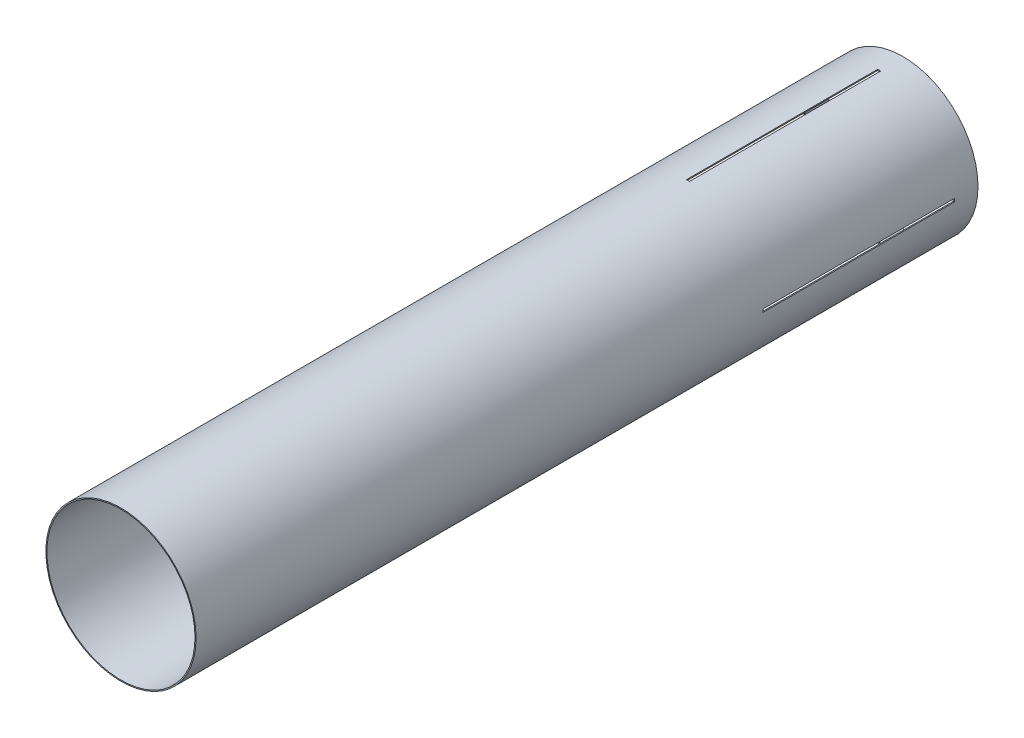
ISO-10303-21;
HEADER;
FILE_DESCRIPTION(('STEP AP214'),'2;1');
FILE_NAME('part.step','',(''),(''),'','','');
FILE_SCHEMA(('AUTOMOTIVE_DESIGN { 1 0 10303 214 1 1 1 1 }'));
ENDSEC;
DATA;
#1=APPLICATION_CONTEXT('core data for automotive mechanical design processes');
#2=APPLICATION_PROTOCOL_DEFINITION('international standard','automotive_design',2000,#1);
#3=PRODUCT_CONTEXT('',#1,'mechanical');
#4=PRODUCT('Part','Part','',(#3));
#5=PRODUCT_RELATED_PRODUCT_CATEGORY('part','',(#4));
#6=PRODUCT_DEFINITION_FORMATION('','',#4);
#7=PRODUCT_DEFINITION_CONTEXT('part definition',#1,'design');
#8=PRODUCT_DEFINITION('design','',#6,#7);
#9=PRODUCT_DEFINITION_SHAPE('','',#8);
#10=(LENGTH_UNIT() NAMED_UNIT(*) SI_UNIT(.MILLI.,.METRE.));
#11=(NAMED_UNIT(*) PLANE_ANGLE_UNIT() SI_UNIT($,.RADIAN.));
#12=(NAMED_UNIT(*) SI_UNIT($,.STERADIAN.) SOLID_ANGLE_UNIT());
#13=UNCERTAINTY_MEASURE_WITH_UNIT(LENGTH_MEASURE(1.E-05),#10,'distance_accuracy_value','');
#14=(GEOMETRIC_REPRESENTATION_CONTEXT(3) GLOBAL_UNCERTAINTY_ASSIGNED_CONTEXT((#13)) GLOBAL_UNIT_ASSIGNED_CONTEXT((#10,
#11,#12)) REPRESENTATION_CONTEXT('',''));
#15=CARTESIAN_POINT('',(0.,0.,0.));
#16=DIRECTION('',(0.,0.,1.));
#17=DIRECTION('',(1.,0.,0.));
#18=AXIS2_PLACEMENT_3D('',#15,#16,#17);
#19=CARTESIAN_POINT('',(0.,0.,838.2));
#20=DIRECTION('',(0.,0.,-1.));
#21=DIRECTION('',(-1.,0.,0.));
#22=AXIS2_PLACEMENT_3D('',#19,#20,#21);
#23=CYLINDRICAL_SURFACE('',#22,80.518);
#24=CARTESIAN_POINT('',(0.,0.,25.4));
#25=DIRECTION('',(0.,0.,-1.));
#26=DIRECTION('',(-1.,0.,0.));
#27=AXIS2_PLACEMENT_3D('',#24,#25,#26);
#28=CIRCLE('',#27,80.518);
#29=CARTESIAN_POINT('',(-80.5020973885774,-1.60020000000028,25.4));
#30=VERTEX_POINT('',#29);
#31=CARTESIAN_POINT('',(-80.5020973885774,1.60019999999972,25.4));
#32=VERTEX_POINT('',#31);
#33=EDGE_CURVE('E168',#30,#32,#28,.T.);
#34=ORIENTED_EDGE('',*,*,#33,.T.);
#35=DIRECTION('',(0.,0.,-1.));
#36=VECTOR('',#35,1.);
#37=CARTESIAN_POINT('',(-80.5020973885774,1.60019999999982,838.2));
#38=LINE('',#37,#36);
#39=CARTESIAN_POINT('',(-80.5020973885774,1.60019999999975,230.378));
#40=VERTEX_POINT('',#39);
#41=EDGE_CURVE('E251',#32,#40,#38,.F.);
#42=ORIENTED_EDGE('',*,*,#41,.T.);
#43=CARTESIAN_POINT('',(0.,0.,230.378));
#44=DIRECTION('',(0.,0.,1.));
#45=DIRECTION('',(1.,0.,0.));
#46=AXIS2_PLACEMENT_3D('',#43,#44,#45);
#47=CIRCLE('',#46,80.518);
#48=CARTESIAN_POINT('',(-80.5020973885774,-1.60020000000025,230.378));
#49=VERTEX_POINT('',#48);
#50=EDGE_CURVE('E51',#40,#49,#47,.T.);
#51=ORIENTED_EDGE('',*,*,#50,.T.);
#52=DIRECTION('',(0.,0.,-1.));
#53=VECTOR('',#52,1.);
#54=CARTESIAN_POINT('',(-80.5020973885774,-1.60020000000018,838.2));
#55=LINE('',#54,#53);
#56=EDGE_CURVE('E254',#49,#30,#55,.T.);
#57=ORIENTED_EDGE('',*,*,#56,.T.);
#58=EDGE_LOOP('',(#34,#42,#51,#57));
#59=FACE_BOUND('',#58,.T.);
#60=DIRECTION('',(0.,0.,-1.));
#61=VECTOR('',#60,1.);
#62=CARTESIAN_POINT('',(80.5020973885774,-1.60019999999926,838.2));
#63=LINE('',#62,#61);
#64=CARTESIAN_POINT('',(80.5020973885774,-1.60019999999916,25.4));
#65=VERTEX_POINT('',#64);
#66=CARTESIAN_POINT('',(80.5020973885773,-1.60019999999919,230.378));
#67=VERTEX_POINT('',#66);
#68=EDGE_CURVE('E235',#65,#67,#63,.F.);
#69=ORIENTED_EDGE('',*,*,#68,.T.);
#70=CARTESIAN_POINT('',(0.,0.,230.378));
#71=DIRECTION('',(0.,0.,1.));
#72=DIRECTION('',(1.,0.,0.));
#73=AXIS2_PLACEMENT_3D('',#70,#71,#72);
#74=CIRCLE('',#73,80.518);
#75=CARTESIAN_POINT('',(80.5020973885773,1.60020000000081,230.378));
#76=VERTEX_POINT('',#75);
#77=EDGE_CURVE('E238',#67,#76,#74,.T.);
#78=ORIENTED_EDGE('',*,*,#77,.T.);
#79=DIRECTION('',(0.,0.,-1.));
#80=VECTOR('',#79,1.);
#81=CARTESIAN_POINT('',(80.5020973885774,1.60020000000074,838.2));
#82=LINE('',#81,#80);
#83=CARTESIAN_POINT('',(80.5020973885774,1.60020000000074,25.4000000000001));
#84=VERTEX_POINT('',#83);
#85=EDGE_CURVE('E186',#76,#84,#82,.T.);
#86=ORIENTED_EDGE('',*,*,#85,.T.);
#87=CARTESIAN_POINT('',(0.,0.,25.4));
#88=DIRECTION('',(0.,0.,-1.));
#89=DIRECTION('',(-1.,0.,0.));
#90=AXIS2_PLACEMENT_3D('',#87,#88,#89);
#91=CIRCLE('',#90,80.518);
#92=EDGE_CURVE('E233',#84,#65,#91,.T.);
#93=ORIENTED_EDGE('',*,*,#92,.T.);
#94=EDGE_LOOP('',(#69,#78,#86,#93));
#95=FACE_BOUND('',#94,.T.);
#96=CARTESIAN_POINT('',(0.,0.,0.));
#97=DIRECTION('',(0.,0.,1.));
#98=DIRECTION('',(1.,0.,0.));
#99=AXIS2_PLACEMENT_3D('',#96,#97,#98);
#100=CIRCLE('',#99,80.518);
#101=CARTESIAN_POINT('',(80.518,0.,0.));
#102=VERTEX_POINT('',#101);
#103=EDGE_CURVE('E40',#102,#102,#100,.T.);
#104=ORIENTED_EDGE('',*,*,#103,.T.);
#105=EDGE_LOOP('',(#104));
#106=FACE_BOUND('',#105,.T.);
#107=CARTESIAN_POINT('',(0.,0.,838.2));
#108=DIRECTION('',(0.,0.,1.));
#109=DIRECTION('',(1.,0.,0.));
#110=AXIS2_PLACEMENT_3D('',#107,#108,#109);
#111=CIRCLE('',#110,80.518);
#112=CARTESIAN_POINT('',(80.518,0.,838.2));
#113=VERTEX_POINT('',#112);
#114=EDGE_CURVE('E11',#113,#113,#111,.T.);
#115=ORIENTED_EDGE('',*,*,#114,.F.);
#116=EDGE_LOOP('',(#115));
#117=FACE_BOUND('',#116,.T.);
#118=CARTESIAN_POINT('',(0.,0.,25.4));
#119=DIRECTION('',(0.,0.,-1.));
#120=DIRECTION('',(-1.,0.,0.));
#121=AXIS2_PLACEMENT_3D('',#118,#119,#120);
#122=CIRCLE('',#121,80.518);
#123=CARTESIAN_POINT('',(-1.6001999999999,80.5020973885774,25.4000000000001));
#124=VERTEX_POINT('',#123);
#125=CARTESIAN_POINT('',(1.6002,80.5020973885774,25.4));
#126=VERTEX_POINT('',#125);
#127=EDGE_CURVE('E282',#124,#126,#122,.T.);
#128=ORIENTED_EDGE('',*,*,#127,.T.);
#129=DIRECTION('',(0.,0.,-1.));
#130=VECTOR('',#129,1.);
#131=CARTESIAN_POINT('',(1.6002000000001,80.5020973885774,838.2));
#132=LINE('',#131,#130);
#133=CARTESIAN_POINT('',(1.60020000000003,80.5020973885774,230.378));
#134=VERTEX_POINT('',#133);
#135=EDGE_CURVE('E284',#126,#134,#132,.F.);
#136=ORIENTED_EDGE('',*,*,#135,.T.);
#137=CARTESIAN_POINT('',(0.,0.,230.378));
#138=DIRECTION('',(0.,0.,1.));
#139=DIRECTION('',(1.,0.,0.));
#140=AXIS2_PLACEMENT_3D('',#137,#138,#139);
#141=CIRCLE('',#140,80.518);
#142=CARTESIAN_POINT('',(-1.60019999999997,80.5020973885774,230.378));
#143=VERTEX_POINT('',#142);
#144=EDGE_CURVE('E287',#134,#143,#141,.T.);
#145=ORIENTED_EDGE('',*,*,#144,.T.);
#146=DIRECTION('',(0.,0.,-1.));
#147=VECTOR('',#146,1.);
#148=CARTESIAN_POINT('',(-1.6001999999999,80.5020973885774,838.2));
#149=LINE('',#148,#147);
#150=EDGE_CURVE('E274',#143,#124,#149,.T.);
#151=ORIENTED_EDGE('',*,*,#150,.T.);
#152=EDGE_LOOP('',(#128,#136,#145,#151));
#153=FACE_BOUND('',#152,.T.);
#154=CARTESIAN_POINT('',(0.,0.,25.4));
#155=DIRECTION('',(0.,0.,-1.));
#156=DIRECTION('',(-1.,0.,0.));
#157=AXIS2_PLACEMENT_3D('',#154,#155,#156);
#158=CIRCLE('',#157,80.518);
#159=CARTESIAN_POINT('',(1.6001999999999,-80.5020973885774,25.4000000000001));
#160=VERTEX_POINT('',#159);
#161=CARTESIAN_POINT('',(-1.6002,-80.5020973885774,25.4));
#162=VERTEX_POINT('',#161);
#163=EDGE_CURVE('E243',#160,#162,#158,.T.);
#164=ORIENTED_EDGE('',*,*,#163,.T.);
#165=DIRECTION('',(0.,0.,-1.));
#166=VECTOR('',#165,1.);
#167=CARTESIAN_POINT('',(-1.6002000000001,-80.5020973885774,838.2));
#168=LINE('',#167,#166);
#169=CARTESIAN_POINT('',(-1.60020000000003,-80.5020973885774,230.378));
#170=VERTEX_POINT('',#169);
#171=EDGE_CURVE('E245',#162,#170,#168,.F.);
#172=ORIENTED_EDGE('',*,*,#171,.T.);
#173=CARTESIAN_POINT('',(0.,0.,230.378));
#174=DIRECTION('',(0.,0.,1.));
#175=DIRECTION('',(1.,0.,0.));
#176=AXIS2_PLACEMENT_3D('',#173,#174,#175);
#177=CIRCLE('',#176,80.518);
#178=CARTESIAN_POINT('',(1.60019999999997,-80.5020973885774,230.378));
#179=VERTEX_POINT('',#178);
#180=EDGE_CURVE('E248',#170,#179,#177,.T.);
#181=ORIENTED_EDGE('',*,*,#180,.T.);
#182=DIRECTION('',(0.,0.,-1.));
#183=VECTOR('',#182,1.);
#184=CARTESIAN_POINT('',(1.6001999999999,-80.5020973885774,838.2));
#185=LINE('',#184,#183);
#186=EDGE_CURVE('E240',#179,#160,#185,.T.);
#187=ORIENTED_EDGE('',*,*,#186,.T.);
#188=EDGE_LOOP('',(#164,#172,#181,#187));
#189=FACE_BOUND('',#188,.T.);
#190=ADVANCED_FACE('F37',(#59,#95,#106,#117,#153,#189),#23,.T.);
#191=CARTESIAN_POINT('',(0.,0.,838.2));
#192=DIRECTION('',(0.,0.,1.));
#193=DIRECTION('',(1.,0.,0.));
#194=AXIS2_PLACEMENT_3D('',#191,#192,#193);
#195=PLANE('',#194);
#196=ORIENTED_EDGE('',*,*,#114,.T.);
#197=EDGE_LOOP('',(#196));
#198=FACE_BOUND('',#197,.T.);
#199=CARTESIAN_POINT('',(0.,0.,838.2));
#200=DIRECTION('',(0.,0.,1.));
#201=DIRECTION('',(1.,0.,0.));
#202=AXIS2_PLACEMENT_3D('',#199,#200,#201);
#203=CIRCLE('',#202,79.375);
#204=CARTESIAN_POINT('',(79.375,0.,838.2));
#205=VERTEX_POINT('',#204);
#206=EDGE_CURVE('E290',#205,#205,#203,.T.);
#207=ORIENTED_EDGE('',*,*,#206,.F.);
#208=EDGE_LOOP('',(#207));
#209=FACE_BOUND('',#208,.T.);
#210=ADVANCED_FACE('F308',(#198,#209),#195,.T.);
#211=CARTESIAN_POINT('',(0.,0.,0.));
#212=DIRECTION('',(0.,0.,1.));
#213=DIRECTION('',(1.,0.,0.));
#214=AXIS2_PLACEMENT_3D('',#211,#212,#213);
#215=PLANE('',#214);
#216=ORIENTED_EDGE('',*,*,#103,.F.);
#217=EDGE_LOOP('',(#216));
#218=FACE_BOUND('',#217,.T.);
#219=CARTESIAN_POINT('',(0.,0.,0.));
#220=DIRECTION('',(0.,0.,1.));
#221=DIRECTION('',(1.,0.,0.));
#222=AXIS2_PLACEMENT_3D('',#219,#220,#221);
#223=CIRCLE('',#222,79.375);
#224=CARTESIAN_POINT('',(79.375,0.,0.));
#225=VERTEX_POINT('',#224);
#226=EDGE_CURVE('E289',#225,#225,#223,.T.);
#227=ORIENTED_EDGE('',*,*,#226,.T.);
#228=EDGE_LOOP('',(#227));
#229=FACE_BOUND('',#228,.T.);
#230=ADVANCED_FACE('F296',(#218,#229),#215,.F.);
#231=CARTESIAN_POINT('',(0.,0.,838.2));
#232=DIRECTION('',(0.,0.,-1.));
#233=DIRECTION('',(-1.,0.,0.));
#234=AXIS2_PLACEMENT_3D('',#231,#232,#233);
#235=CYLINDRICAL_SURFACE('',#234,79.375);
#236=DIRECTION('',(0.,0.,-1.));
#237=VECTOR('',#236,1.);
#238=CARTESIAN_POINT('',(-79.358868344754,-1.60020000000018,838.2));
#239=LINE('',#238,#237);
#240=CARTESIAN_POINT('',(-79.358868344754,-1.60020000000027,25.4));
#241=VERTEX_POINT('',#240);
#242=CARTESIAN_POINT('',(-79.358868344754,-1.60020000000025,230.378));
#243=VERTEX_POINT('',#242);
#244=EDGE_CURVE('E152',#241,#243,#239,.F.);
#245=ORIENTED_EDGE('',*,*,#244,.T.);
#246=CARTESIAN_POINT('',(0.,0.,230.378));
#247=DIRECTION('',(0.,0.,1.));
#248=DIRECTION('',(1.,0.,0.));
#249=AXIS2_PLACEMENT_3D('',#246,#247,#248);
#250=CIRCLE('',#249,79.375);
#251=CARTESIAN_POINT('',(-79.358868344754,1.60019999999975,230.378));
#252=VERTEX_POINT('',#251);
#253=EDGE_CURVE('E181',#243,#252,#250,.F.);
#254=ORIENTED_EDGE('',*,*,#253,.T.);
#255=DIRECTION('',(0.,0.,-1.));
#256=VECTOR('',#255,1.);
#257=CARTESIAN_POINT('',(-79.358868344754,1.60019999999983,838.2));
#258=LINE('',#257,#256);
#259=CARTESIAN_POINT('',(-79.358868344754,1.60019999999983,25.4000000000001));
#260=VERTEX_POINT('',#259);
#261=EDGE_CURVE('E169',#252,#260,#258,.T.);
#262=ORIENTED_EDGE('',*,*,#261,.T.);
#263=CARTESIAN_POINT('',(0.,0.,25.4));
#264=DIRECTION('',(0.,0.,-1.));
#265=DIRECTION('',(-1.,0.,0.));
#266=AXIS2_PLACEMENT_3D('',#263,#264,#265);
#267=CIRCLE('',#266,79.375);
#268=EDGE_CURVE('E166',#260,#241,#267,.F.);
#269=ORIENTED_EDGE('',*,*,#268,.T.);
#270=EDGE_LOOP('',(#245,#254,#262,#269));
#271=FACE_BOUND('',#270,.T.);
#272=CARTESIAN_POINT('',(0.,0.,230.378));
#273=DIRECTION('',(0.,0.,1.));
#274=DIRECTION('',(1.,0.,0.));
#275=AXIS2_PLACEMENT_3D('',#272,#273,#274);
#276=CIRCLE('',#275,79.375);
#277=CARTESIAN_POINT('',(1.6001999999999,-79.358868344754,230.378));
#278=VERTEX_POINT('',#277);
#279=CARTESIAN_POINT('',(-1.60020000000003,-79.358868344754,230.378));
#280=VERTEX_POINT('',#279);
#281=EDGE_CURVE('E187',#278,#280,#276,.F.);
#282=ORIENTED_EDGE('',*,*,#281,.T.);
#283=DIRECTION('',(0.,0.,-1.));
#284=VECTOR('',#283,1.);
#285=CARTESIAN_POINT('',(-1.6002000000001,-79.358868344754,838.2));
#286=LINE('',#285,#284);
#287=CARTESIAN_POINT('',(-1.6002000000001,-79.358868344754,25.4000000000001));
#288=VERTEX_POINT('',#287);
#289=EDGE_CURVE('E199',#280,#288,#286,.T.);
#290=ORIENTED_EDGE('',*,*,#289,.T.);
#291=CARTESIAN_POINT('',(0.,0.,25.4));
#292=DIRECTION('',(0.,0.,-1.));
#293=DIRECTION('',(-1.,0.,0.));
#294=AXIS2_PLACEMENT_3D('',#291,#292,#293);
#295=CIRCLE('',#294,79.375);
#296=CARTESIAN_POINT('',(1.6002,-79.358868344754,25.4));
#297=VERTEX_POINT('',#296);
#298=EDGE_CURVE('E195',#288,#297,#295,.F.);
#299=ORIENTED_EDGE('',*,*,#298,.T.);
#300=DIRECTION('',(0.,0.,-1.));
#301=VECTOR('',#300,1.);
#302=CARTESIAN_POINT('',(1.6001999999999,-79.358868344754,838.2));
#303=LINE('',#302,#301);
#304=EDGE_CURVE('E192',#297,#278,#303,.F.);
#305=ORIENTED_EDGE('',*,*,#304,.T.);
#306=EDGE_LOOP('',(#282,#290,#299,#305));
#307=FACE_BOUND('',#306,.T.);
#308=CARTESIAN_POINT('',(0.,0.,230.378));
#309=DIRECTION('',(0.,0.,1.));
#310=DIRECTION('',(1.,0.,0.));
#311=AXIS2_PLACEMENT_3D('',#308,#309,#310);
#312=CIRCLE('',#311,79.375);
#313=CARTESIAN_POINT('',(79.358868344754,1.60020000000073,230.378));
#314=VERTEX_POINT('',#313);
#315=CARTESIAN_POINT('',(79.358868344754,-1.6001999999992,230.378));
#316=VERTEX_POINT('',#315);
#317=EDGE_CURVE('E209',#314,#316,#312,.F.);
#318=ORIENTED_EDGE('',*,*,#317,.T.);
#319=DIRECTION('',(0.,0.,-1.));
#320=VECTOR('',#319,1.);
#321=CARTESIAN_POINT('',(79.358868344754,-1.60019999999927,838.2));
#322=LINE('',#321,#320);
#323=CARTESIAN_POINT('',(79.358868344754,-1.60019999999927,25.4000000000001));
#324=VERTEX_POINT('',#323);
#325=EDGE_CURVE('E221',#316,#324,#322,.T.);
#326=ORIENTED_EDGE('',*,*,#325,.T.);
#327=CARTESIAN_POINT('',(0.,0.,25.4));
#328=DIRECTION('',(0.,0.,-1.));
#329=DIRECTION('',(-1.,0.,0.));
#330=AXIS2_PLACEMENT_3D('',#327,#328,#329);
#331=CIRCLE('',#330,79.375);
#332=CARTESIAN_POINT('',(79.358868344754,1.60020000000083,25.4));
#333=VERTEX_POINT('',#332);
#334=EDGE_CURVE('E217',#324,#333,#331,.F.);
#335=ORIENTED_EDGE('',*,*,#334,.T.);
#336=DIRECTION('',(0.,0.,-1.));
#337=VECTOR('',#336,1.);
#338=CARTESIAN_POINT('',(79.358868344754,1.60020000000073,838.2));
#339=LINE('',#338,#337);
#340=EDGE_CURVE('E213',#333,#314,#339,.F.);
#341=ORIENTED_EDGE('',*,*,#340,.T.);
#342=EDGE_LOOP('',(#318,#326,#335,#341));
#343=FACE_BOUND('',#342,.T.);
#344=CARTESIAN_POINT('',(0.,0.,230.378));
#345=DIRECTION('',(0.,0.,1.));
#346=DIRECTION('',(1.,0.,0.));
#347=AXIS2_PLACEMENT_3D('',#344,#345,#346);
#348=CIRCLE('',#347,79.375);
#349=CARTESIAN_POINT('',(-1.6001999999999,79.358868344754,230.378));
#350=VERTEX_POINT('',#349);
#351=CARTESIAN_POINT('',(1.60020000000003,79.358868344754,230.378));
#352=VERTEX_POINT('',#351);
#353=EDGE_CURVE('E256',#350,#352,#348,.F.);
#354=ORIENTED_EDGE('',*,*,#353,.T.);
#355=DIRECTION('',(0.,0.,-1.));
#356=VECTOR('',#355,1.);
#357=CARTESIAN_POINT('',(1.6002000000001,79.358868344754,838.2));
#358=LINE('',#357,#356);
#359=CARTESIAN_POINT('',(1.6002000000001,79.358868344754,25.4000000000001));
#360=VERTEX_POINT('',#359);
#361=EDGE_CURVE('E269',#352,#360,#358,.T.);
#362=ORIENTED_EDGE('',*,*,#361,.T.);
#363=CARTESIAN_POINT('',(0.,0.,25.4));
#364=DIRECTION('',(0.,0.,-1.));
#365=DIRECTION('',(-1.,0.,0.));
#366=AXIS2_PLACEMENT_3D('',#363,#364,#365);
#367=CIRCLE('',#366,79.375);
#368=CARTESIAN_POINT('',(-1.6002,79.358868344754,25.4));
#369=VERTEX_POINT('',#368);
#370=EDGE_CURVE('E265',#360,#369,#367,.F.);
#371=ORIENTED_EDGE('',*,*,#370,.T.);
#372=DIRECTION('',(0.,0.,-1.));
#373=VECTOR('',#372,1.);
#374=CARTESIAN_POINT('',(-1.6001999999999,79.358868344754,838.2));
#375=LINE('',#374,#373);
#376=EDGE_CURVE('E260',#369,#350,#375,.F.);
#377=ORIENTED_EDGE('',*,*,#376,.T.);
#378=EDGE_LOOP('',(#354,#362,#371,#377));
#379=FACE_BOUND('',#378,.T.);
#380=ORIENTED_EDGE('',*,*,#206,.T.);
#381=EDGE_LOOP('',(#380));
#382=FACE_BOUND('',#381,.T.);
#383=ORIENTED_EDGE('',*,*,#226,.F.);
#384=EDGE_LOOP('',(#383));
#385=FACE_BOUND('',#384,.T.);
#386=ADVANCED_FACE('F172',(#271,#307,#343,#379,#382,#385),#235,.F.);
#387=CARTESIAN_POINT('',(-1.60019999999997,-80.519,230.378));
#388=DIRECTION('',(0.,0.,1.));
#389=DIRECTION('',(1.,0.,0.));
#390=AXIS2_PLACEMENT_3D('',#387,#388,#389);
#391=PLANE('',#390);
#392=DIRECTION('',(0.,1.,0.));
#393=VECTOR('',#392,1.);
#394=CARTESIAN_POINT('',(1.60020000000003,-80.519,230.378));
#395=LINE('',#394,#393);
#396=EDGE_CURVE('E259',#352,#134,#395,.T.);
#397=ORIENTED_EDGE('',*,*,#396,.F.);
#398=ORIENTED_EDGE('',*,*,#353,.F.);
#399=DIRECTION('',(0.,1.,0.));
#400=VECTOR('',#399,1.);
#401=CARTESIAN_POINT('',(-1.60019999999997,-80.519,230.378));
#402=LINE('',#401,#400);
#403=EDGE_CURVE('E263',#350,#143,#402,.T.);
#404=ORIENTED_EDGE('',*,*,#403,.T.);
#405=ORIENTED_EDGE('',*,*,#144,.F.);
#406=EDGE_LOOP('',(#397,#398,#404,#405));
#407=FACE_BOUND('',#406,.T.);
#408=ADVANCED_FACE('F299',(#407),#391,.F.);
#409=CARTESIAN_POINT('',(1.6002,-80.519,25.4));
#410=DIRECTION('',(1.,0.,0.));
#411=DIRECTION('',(0.,0.,-1.));
#412=AXIS2_PLACEMENT_3D('',#409,#410,#411);
#413=PLANE('',#412);
#414=DIRECTION('',(0.,1.,0.));
#415=VECTOR('',#414,1.);
#416=CARTESIAN_POINT('',(1.6002,-80.519,25.4));
#417=LINE('',#416,#415);
#418=EDGE_CURVE('E268',#360,#126,#417,.T.);
#419=ORIENTED_EDGE('',*,*,#418,.F.);
#420=ORIENTED_EDGE('',*,*,#361,.F.);
#421=ORIENTED_EDGE('',*,*,#396,.T.);
#422=ORIENTED_EDGE('',*,*,#135,.F.);
#423=EDGE_LOOP('',(#419,#420,#421,#422));
#424=FACE_BOUND('',#423,.T.);
#425=ADVANCED_FACE('F305',(#424),#413,.F.);
#426=CARTESIAN_POINT('',(-1.6002,-80.519,25.4));
#427=DIRECTION('',(0.,0.,-1.));
#428=DIRECTION('',(-1.,0.,0.));
#429=AXIS2_PLACEMENT_3D('',#426,#427,#428);
#430=PLANE('',#429);
#431=DIRECTION('',(0.,1.,0.));
#432=VECTOR('',#431,1.);
#433=CARTESIAN_POINT('',(-1.6002,-80.519,25.4));
#434=LINE('',#433,#432);
#435=EDGE_CURVE('E264',#369,#124,#434,.T.);
#436=ORIENTED_EDGE('',*,*,#435,.F.);
#437=ORIENTED_EDGE('',*,*,#370,.F.);
#438=ORIENTED_EDGE('',*,*,#418,.T.);
#439=ORIENTED_EDGE('',*,*,#127,.F.);
#440=EDGE_LOOP('',(#436,#437,#438,#439));
#441=FACE_BOUND('',#440,.T.);
#442=ADVANCED_FACE('F373',(#441),#430,.F.);
#443=CARTESIAN_POINT('',(-1.6002,-80.519,25.4));
#444=DIRECTION('',(-1.,0.,0.));
#445=DIRECTION('',(0.,0.,1.));
#446=AXIS2_PLACEMENT_3D('',#443,#444,#445);
#447=PLANE('',#446);
#448=ORIENTED_EDGE('',*,*,#403,.F.);
#449=ORIENTED_EDGE('',*,*,#376,.F.);
#450=ORIENTED_EDGE('',*,*,#435,.T.);
#451=ORIENTED_EDGE('',*,*,#150,.F.);
#452=EDGE_LOOP('',(#448,#449,#450,#451));
#453=FACE_BOUND('',#452,.T.);
#454=ADVANCED_FACE('F367',(#453),#447,.F.);
#455=CARTESIAN_POINT('',(-80.5190000000008,1.60019999999913,230.378));
#456=DIRECTION('',(0.,0.,1.));
#457=DIRECTION('',(1.,0.,0.));
#458=AXIS2_PLACEMENT_3D('',#455,#456,#457);
#459=PLANE('',#458);
#460=ORIENTED_EDGE('',*,*,#77,.F.);
#461=DIRECTION('',(1.,0.,0.));
#462=VECTOR('',#461,1.);
#463=CARTESIAN_POINT('',(-80.5190000000008,-1.60020000000087,230.378));
#464=LINE('',#463,#462);
#465=EDGE_CURVE('E212',#316,#67,#464,.T.);
#466=ORIENTED_EDGE('',*,*,#465,.F.);
#467=ORIENTED_EDGE('',*,*,#317,.F.);
#468=DIRECTION('',(1.,0.,0.));
#469=VECTOR('',#468,1.);
#470=CARTESIAN_POINT('',(-80.5190000000008,1.60019999999913,230.378));
#471=LINE('',#470,#469);
#472=EDGE_CURVE('E191',#314,#76,#471,.T.);
#473=ORIENTED_EDGE('',*,*,#472,.T.);
#474=EDGE_LOOP('',(#460,#466,#467,#473));
#475=FACE_BOUND('',#474,.T.);
#476=ADVANCED_FACE('F364',(#475),#459,.F.);
#477=CARTESIAN_POINT('',(-80.5190000000008,-1.60020000000085,25.4));
#478=DIRECTION('',(0.,-1.,0.));
#479=DIRECTION('',(1.,0.,0.));
#480=AXIS2_PLACEMENT_3D('',#477,#478,#479);
#481=PLANE('',#480);
#482=DIRECTION('',(1.,0.,0.));
#483=VECTOR('',#482,1.);
#484=CARTESIAN_POINT('',(-80.5190000000008,-1.60020000000085,25.4));
#485=LINE('',#484,#483);
#486=EDGE_CURVE('E220',#324,#65,#485,.T.);
#487=ORIENTED_EDGE('',*,*,#486,.F.);
#488=ORIENTED_EDGE('',*,*,#325,.F.);
#489=ORIENTED_EDGE('',*,*,#465,.T.);
#490=ORIENTED_EDGE('',*,*,#68,.F.);
#491=EDGE_LOOP('',(#487,#488,#489,#490));
#492=FACE_BOUND('',#491,.T.);
#493=ADVANCED_FACE('F359',(#492),#481,.F.);
#494=CARTESIAN_POINT('',(-80.5190000000008,1.60019999999915,25.4));
#495=DIRECTION('',(0.,0.,-1.));
#496=DIRECTION('',(-1.,0.,0.));
#497=AXIS2_PLACEMENT_3D('',#494,#495,#496);
#498=PLANE('',#497);
#499=DIRECTION('',(1.,0.,0.));
#500=VECTOR('',#499,1.);
#501=CARTESIAN_POINT('',(-80.5190000000008,1.60019999999915,25.4));
#502=LINE('',#501,#500);
#503=EDGE_CURVE('E216',#333,#84,#502,.T.);
#504=ORIENTED_EDGE('',*,*,#503,.F.);
#505=ORIENTED_EDGE('',*,*,#334,.F.);
#506=ORIENTED_EDGE('',*,*,#486,.T.);
#507=ORIENTED_EDGE('',*,*,#92,.F.);
#508=EDGE_LOOP('',(#504,#505,#506,#507));
#509=FACE_BOUND('',#508,.T.);
#510=ADVANCED_FACE('F356',(#509),#498,.F.);
#511=CARTESIAN_POINT('',(-80.5190000000008,1.60019999999915,25.4));
#512=DIRECTION('',(0.,1.,0.));
#513=DIRECTION('',(-1.,0.,0.));
#514=AXIS2_PLACEMENT_3D('',#511,#512,#513);
#515=PLANE('',#514);
#516=ORIENTED_EDGE('',*,*,#472,.F.);
#517=ORIENTED_EDGE('',*,*,#340,.F.);
#518=ORIENTED_EDGE('',*,*,#503,.T.);
#519=ORIENTED_EDGE('',*,*,#85,.F.);
#520=EDGE_LOOP('',(#516,#517,#518,#519));
#521=FACE_BOUND('',#520,.T.);
#522=ADVANCED_FACE('F355',(#521),#515,.F.);
#523=CARTESIAN_POINT('',(1.60019999999997,80.519,230.378));
#524=DIRECTION('',(0.,0.,1.));
#525=DIRECTION('',(1.,0.,0.));
#526=AXIS2_PLACEMENT_3D('',#523,#524,#525);
#527=PLANE('',#526);
#528=DIRECTION('',(0.,-1.,0.));
#529=VECTOR('',#528,1.);
#530=CARTESIAN_POINT('',(-1.60020000000003,80.519,230.378));
#531=LINE('',#530,#529);
#532=EDGE_CURVE('E190',#280,#170,#531,.T.);
#533=ORIENTED_EDGE('',*,*,#532,.F.);
#534=ORIENTED_EDGE('',*,*,#281,.F.);
#535=DIRECTION('',(0.,-1.,0.));
#536=VECTOR('',#535,1.);
#537=CARTESIAN_POINT('',(1.60019999999997,80.519,230.378));
#538=LINE('',#537,#536);
#539=EDGE_CURVE('E161',#278,#179,#538,.T.);
#540=ORIENTED_EDGE('',*,*,#539,.T.);
#541=ORIENTED_EDGE('',*,*,#180,.F.);
#542=EDGE_LOOP('',(#533,#534,#540,#541));
#543=FACE_BOUND('',#542,.T.);
#544=ADVANCED_FACE('F339',(#543),#527,.F.);
#545=CARTESIAN_POINT('',(-1.6002,80.519,25.4));
#546=DIRECTION('',(-1.,0.,0.));
#547=DIRECTION('',(0.,0.,1.));
#548=AXIS2_PLACEMENT_3D('',#545,#546,#547);
#549=PLANE('',#548);
#550=DIRECTION('',(0.,-1.,0.));
#551=VECTOR('',#550,1.);
#552=CARTESIAN_POINT('',(-1.6002,80.519,25.4));
#553=LINE('',#552,#551);
#554=EDGE_CURVE('E198',#288,#162,#553,.T.);
#555=ORIENTED_EDGE('',*,*,#554,.F.);
#556=ORIENTED_EDGE('',*,*,#289,.F.);
#557=ORIENTED_EDGE('',*,*,#532,.T.);
#558=ORIENTED_EDGE('',*,*,#171,.F.);
#559=EDGE_LOOP('',(#555,#556,#557,#558));
#560=FACE_BOUND('',#559,.T.);
#561=ADVANCED_FACE('F333',(#560),#549,.F.);
#562=CARTESIAN_POINT('',(1.6002,80.519,25.4));
#563=DIRECTION('',(0.,0.,-1.));
#564=DIRECTION('',(-1.,0.,0.));
#565=AXIS2_PLACEMENT_3D('',#562,#563,#564);
#566=PLANE('',#565);
#567=DIRECTION('',(0.,-1.,0.));
#568=VECTOR('',#567,1.);
#569=CARTESIAN_POINT('',(1.6002,80.519,25.4));
#570=LINE('',#569,#568);
#571=EDGE_CURVE('E59',#297,#160,#570,.T.);
#572=ORIENTED_EDGE('',*,*,#571,.F.);
#573=ORIENTED_EDGE('',*,*,#298,.F.);
#574=ORIENTED_EDGE('',*,*,#554,.T.);
#575=ORIENTED_EDGE('',*,*,#163,.F.);
#576=EDGE_LOOP('',(#572,#573,#574,#575));
#577=FACE_BOUND('',#576,.T.);
#578=ADVANCED_FACE('F335',(#577),#566,.F.);
#579=CARTESIAN_POINT('',(1.6002,80.519,25.4));
#580=DIRECTION('',(1.,0.,0.));
#581=DIRECTION('',(0.,0.,-1.));
#582=AXIS2_PLACEMENT_3D('',#579,#580,#581);
#583=PLANE('',#582);
#584=ORIENTED_EDGE('',*,*,#539,.F.);
#585=ORIENTED_EDGE('',*,*,#304,.F.);
#586=ORIENTED_EDGE('',*,*,#571,.T.);
#587=ORIENTED_EDGE('',*,*,#186,.F.);
#588=EDGE_LOOP('',(#584,#585,#586,#587));
#589=FACE_BOUND('',#588,.T.);
#590=ADVANCED_FACE('F340',(#589),#583,.F.);
#591=CARTESIAN_POINT('',(80.5190000000003,-1.60019999999972,25.4));
#592=DIRECTION('',(0.,-1.,0.));
#593=DIRECTION('',(1.,0.,0.));
#594=AXIS2_PLACEMENT_3D('',#591,#592,#593);
#595=PLANE('',#594);
#596=DIRECTION('',(-1.,0.,0.));
#597=VECTOR('',#596,1.);
#598=CARTESIAN_POINT('',(80.5190000000003,-1.60019999999969,230.378));
#599=LINE('',#598,#597);
#600=EDGE_CURVE('E157',#243,#49,#599,.T.);
#601=ORIENTED_EDGE('',*,*,#600,.F.);
#602=ORIENTED_EDGE('',*,*,#244,.F.);
#603=DIRECTION('',(-1.,0.,0.));
#604=VECTOR('',#603,1.);
#605=CARTESIAN_POINT('',(80.5190000000003,-1.60019999999972,25.4));
#606=LINE('',#605,#604);
#607=EDGE_CURVE('E156',#241,#30,#606,.T.);
#608=ORIENTED_EDGE('',*,*,#607,.T.);
#609=ORIENTED_EDGE('',*,*,#56,.F.);
#610=EDGE_LOOP('',(#601,#602,#608,#609));
#611=FACE_BOUND('',#610,.T.);
#612=ADVANCED_FACE('F154',(#611),#595,.F.);
#613=CARTESIAN_POINT('',(80.5190000000003,-1.60019999999972,25.4));
#614=DIRECTION('',(0.,0.,-1.));
#615=DIRECTION('',(-1.,0.,0.));
#616=AXIS2_PLACEMENT_3D('',#613,#614,#615);
#617=PLANE('',#616);
#618=ORIENTED_EDGE('',*,*,#33,.F.);
#619=ORIENTED_EDGE('',*,*,#607,.F.);
#620=ORIENTED_EDGE('',*,*,#268,.F.);
#621=DIRECTION('',(-1.,0.,0.));
#622=VECTOR('',#621,1.);
#623=CARTESIAN_POINT('',(80.5190000000003,1.60020000000028,25.4));
#624=LINE('',#623,#622);
#625=EDGE_CURVE('E179',#260,#32,#624,.T.);
#626=ORIENTED_EDGE('',*,*,#625,.T.);
#627=EDGE_LOOP('',(#618,#619,#620,#626));
#628=FACE_BOUND('',#627,.T.);
#629=ADVANCED_FACE('F164',(#628),#617,.F.);
#630=CARTESIAN_POINT('',(80.5190000000003,1.60020000000028,25.4));
#631=DIRECTION('',(0.,1.,0.));
#632=DIRECTION('',(-1.,0.,0.));
#633=AXIS2_PLACEMENT_3D('',#630,#631,#632);
#634=PLANE('',#633);
#635=ORIENTED_EDGE('',*,*,#625,.F.);
#636=ORIENTED_EDGE('',*,*,#261,.F.);
#637=DIRECTION('',(-1.,0.,0.));
#638=VECTOR('',#637,1.);
#639=CARTESIAN_POINT('',(80.5190000000003,1.60020000000031,230.378));
#640=LINE('',#639,#638);
#641=EDGE_CURVE('E183',#252,#40,#640,.T.);
#642=ORIENTED_EDGE('',*,*,#641,.T.);
#643=ORIENTED_EDGE('',*,*,#41,.F.);
#644=EDGE_LOOP('',(#635,#636,#642,#643));
#645=FACE_BOUND('',#644,.T.);
#646=ADVANCED_FACE('F447',(#645),#634,.F.);
#647=CARTESIAN_POINT('',(80.5190000000003,-1.60019999999969,230.378));
#648=DIRECTION('',(0.,0.,1.));
#649=DIRECTION('',(1.,0.,0.));
#650=AXIS2_PLACEMENT_3D('',#647,#648,#649);
#651=PLANE('',#650);
#652=ORIENTED_EDGE('',*,*,#641,.F.);
#653=ORIENTED_EDGE('',*,*,#253,.F.);
#654=ORIENTED_EDGE('',*,*,#600,.T.);
#655=ORIENTED_EDGE('',*,*,#50,.F.);
#656=EDGE_LOOP('',(#652,#653,#654,#655));
#657=FACE_BOUND('',#656,.T.);
#658=ADVANCED_FACE('F456',(#657),#651,.F.);
#659=CLOSED_SHELL('',(#190,#210,#230,#386,#408,#425,#442,#454,#476,#493,#510,#522,#544,#561,
#578,#590,#612,#629,#646,#658));
#660=MANIFOLD_SOLID_BREP('B2',#659);
#661=ADVANCED_BREP_SHAPE_REPRESENTATION('',(#18,#660),#14);
#662=SHAPE_DEFINITION_REPRESENTATION(#9,#661);
ENDSEC;
END-ISO-10303-21;
